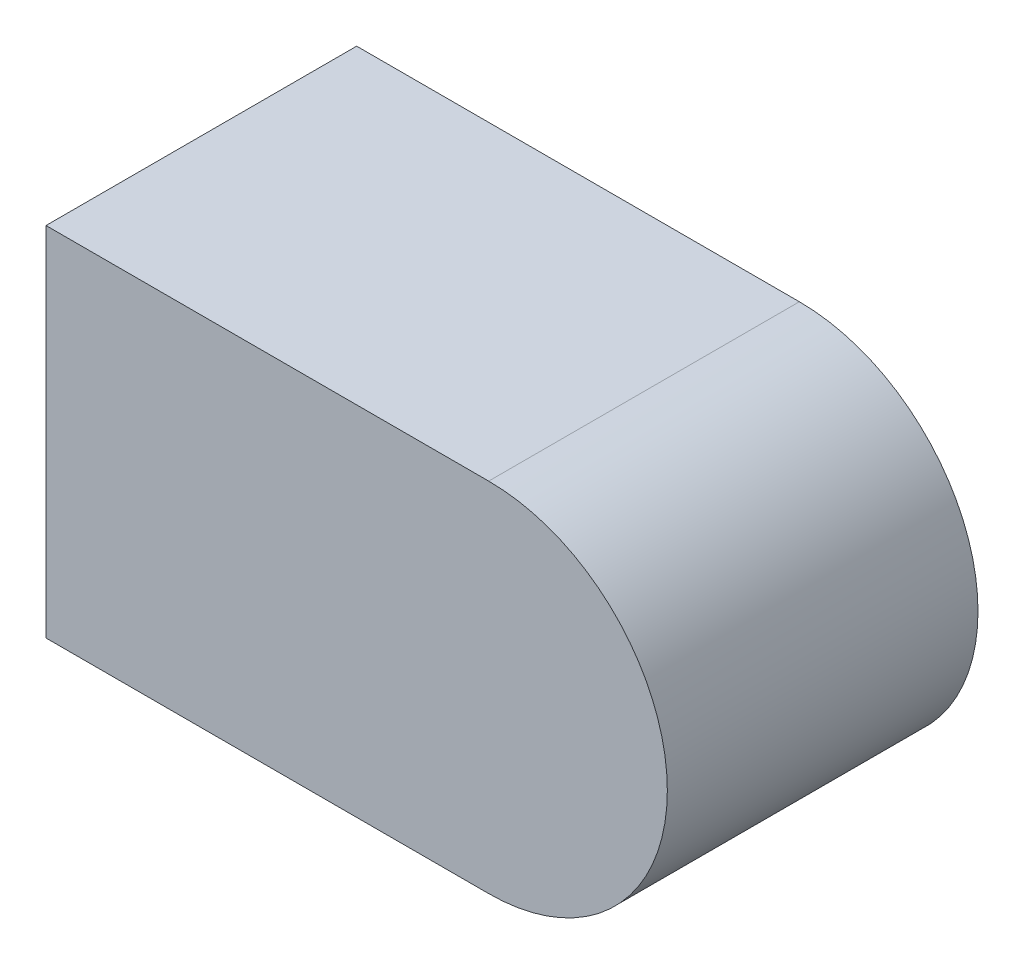
ISO-10303-21;
HEADER;
FILE_DESCRIPTION(('STEP AP214'),'2;1');
FILE_NAME('part.step','',(''),(''),'','','');
FILE_SCHEMA(('AUTOMOTIVE_DESIGN { 1 0 10303 214 1 1 1 1 }'));
ENDSEC;
DATA;
#1=APPLICATION_CONTEXT('core data for automotive mechanical design processes');
#2=APPLICATION_PROTOCOL_DEFINITION('international standard','automotive_design',2000,#1);
#3=PRODUCT_CONTEXT('',#1,'mechanical');
#4=PRODUCT('Part','Part','',(#3));
#5=PRODUCT_RELATED_PRODUCT_CATEGORY('part','',(#4));
#6=PRODUCT_DEFINITION_FORMATION('','',#4);
#7=PRODUCT_DEFINITION_CONTEXT('part definition',#1,'design');
#8=PRODUCT_DEFINITION('design','',#6,#7);
#9=PRODUCT_DEFINITION_SHAPE('','',#8);
#10=(LENGTH_UNIT() NAMED_UNIT(*) SI_UNIT(.MILLI.,.METRE.));
#11=(NAMED_UNIT(*) PLANE_ANGLE_UNIT() SI_UNIT($,.RADIAN.));
#12=(NAMED_UNIT(*) SI_UNIT($,.STERADIAN.) SOLID_ANGLE_UNIT());
#13=UNCERTAINTY_MEASURE_WITH_UNIT(LENGTH_MEASURE(1.E-05),#10,'distance_accuracy_value','');
#14=(GEOMETRIC_REPRESENTATION_CONTEXT(3) GLOBAL_UNCERTAINTY_ASSIGNED_CONTEXT((#13)) GLOBAL_UNIT_ASSIGNED_CONTEXT((#10,
#11,#12)) REPRESENTATION_CONTEXT('',''));
#15=CARTESIAN_POINT('',(0.,0.,0.));
#16=DIRECTION('',(0.,0.,1.));
#17=DIRECTION('',(1.,0.,0.));
#18=AXIS2_PLACEMENT_3D('',#15,#16,#17);
#19=CARTESIAN_POINT('',(-2.8335240809167,-0.75,0.2));
#20=DIRECTION('',(0.,0.,1.));
#21=DIRECTION('',(1.,0.,0.));
#22=AXIS2_PLACEMENT_3D('',#19,#20,#21);
#23=PLANE('',#22);
#24=DIRECTION('',(-1.,0.,0.));
#25=VECTOR('',#24,1.);
#26=CARTESIAN_POINT('',(-2.715,-0.635000000000001,0.2));
#27=LINE('',#26,#25);
#28=CARTESIAN_POINT('',(-2.715,-0.635000000000001,0.2));
#29=VERTEX_POINT('',#28);
#30=CARTESIAN_POINT('',(-3.,-0.635000000000001,0.2));
#31=VERTEX_POINT('',#30);
#32=EDGE_CURVE('E11',#29,#31,#27,.T.);
#33=ORIENTED_EDGE('',*,*,#32,.T.);
#34=DIRECTION('',(0.,-1.,0.));
#35=VECTOR('',#34,1.);
#36=CARTESIAN_POINT('',(-3.,1.125,0.2));
#37=LINE('',#36,#35);
#38=CARTESIAN_POINT('',(-3.,-0.865,0.2));
#39=VERTEX_POINT('',#38);
#40=EDGE_CURVE('E24',#31,#39,#37,.T.);
#41=ORIENTED_EDGE('',*,*,#40,.T.);
#42=DIRECTION('',(1.,0.,0.));
#43=VECTOR('',#42,1.);
#44=CARTESIAN_POINT('',(-3.,-0.865,0.2));
#45=LINE('',#44,#43);
#46=CARTESIAN_POINT('',(-2.715,-0.865,0.2));
#47=VERTEX_POINT('',#46);
#48=EDGE_CURVE('E88',#39,#47,#45,.T.);
#49=ORIENTED_EDGE('',*,*,#48,.T.);
#50=CARTESIAN_POINT('',(-2.715,-0.750000000000001,0.2));
#51=DIRECTION('',(0.,0.,1.));
#52=DIRECTION('',(0.,-1.,0.));
#53=AXIS2_PLACEMENT_3D('',#50,#51,#52);
#54=CIRCLE('',#53,0.115);
#55=EDGE_CURVE('E70',#47,#29,#54,.T.);
#56=ORIENTED_EDGE('',*,*,#55,.T.);
#57=EDGE_LOOP('',(#33,#41,#49,#56));
#58=FACE_BOUND('',#57,.T.);
#59=ADVANCED_FACE('F17',(#58),#23,.T.);
#60=CARTESIAN_POINT('',(-3.,3.,0.));
#61=DIRECTION('',(-1.,0.,0.));
#62=DIRECTION('',(0.,-1.,0.));
#63=AXIS2_PLACEMENT_3D('',#60,#61,#62);
#64=PLANE('',#63);
#65=DIRECTION('',(0.,0.,-1.));
#66=VECTOR('',#65,1.);
#67=CARTESIAN_POINT('',(-3.,-0.865,0.));
#68=LINE('',#67,#66);
#69=CARTESIAN_POINT('',(-3.,-0.865,0.));
#70=VERTEX_POINT('',#69);
#71=EDGE_CURVE('E76',#39,#70,#68,.T.);
#72=ORIENTED_EDGE('',*,*,#71,.F.);
#73=ORIENTED_EDGE('',*,*,#40,.F.);
#74=DIRECTION('',(0.,0.,1.));
#75=VECTOR('',#74,1.);
#76=CARTESIAN_POINT('',(-3.,-0.635000000000001,0.));
#77=LINE('',#76,#75);
#78=CARTESIAN_POINT('',(-3.,-0.635000000000001,0.));
#79=VERTEX_POINT('',#78);
#80=EDGE_CURVE('E84',#79,#31,#77,.T.);
#81=ORIENTED_EDGE('',*,*,#80,.F.);
#82=DIRECTION('',(0.,-1.,0.));
#83=VECTOR('',#82,1.);
#84=CARTESIAN_POINT('',(-3.,-0.635000000000001,0.));
#85=LINE('',#84,#83);
#86=EDGE_CURVE('E82',#79,#70,#85,.T.);
#87=ORIENTED_EDGE('',*,*,#86,.T.);
#88=EDGE_LOOP('',(#72,#73,#81,#87));
#89=FACE_BOUND('',#88,.T.);
#90=ADVANCED_FACE('F90',(#89),#64,.T.);
#91=CARTESIAN_POINT('',(-2.715,-0.635000000000001,0.));
#92=DIRECTION('',(0.,1.,0.));
#93=DIRECTION('',(-1.,0.,0.));
#94=AXIS2_PLACEMENT_3D('',#91,#92,#93);
#95=PLANE('',#94);
#96=DIRECTION('',(-1.,0.,0.));
#97=VECTOR('',#96,1.);
#98=CARTESIAN_POINT('',(-2.715,-0.635000000000001,0.));
#99=LINE('',#98,#97);
#100=CARTESIAN_POINT('',(-2.715,-0.635000000000001,0.));
#101=VERTEX_POINT('',#100);
#102=EDGE_CURVE('E61',#101,#79,#99,.T.);
#103=ORIENTED_EDGE('',*,*,#102,.T.);
#104=ORIENTED_EDGE('',*,*,#80,.T.);
#105=ORIENTED_EDGE('',*,*,#32,.F.);
#106=DIRECTION('',(0.,0.,1.));
#107=VECTOR('',#106,1.);
#108=CARTESIAN_POINT('',(-2.715,-0.635000000000001,0.));
#109=LINE('',#108,#107);
#110=EDGE_CURVE('E64',#101,#29,#109,.T.);
#111=ORIENTED_EDGE('',*,*,#110,.F.);
#112=EDGE_LOOP('',(#103,#104,#105,#111));
#113=FACE_BOUND('',#112,.T.);
#114=ADVANCED_FACE('F91',(#113),#95,.T.);
#115=CARTESIAN_POINT('',(-2.715,-0.750000000000001,0.));
#116=DIRECTION('',(0.,0.,1.));
#117=DIRECTION('',(0.,-1.,0.));
#118=AXIS2_PLACEMENT_3D('',#115,#116,#117);
#119=CYLINDRICAL_SURFACE('',#118,0.115);
#120=CARTESIAN_POINT('',(-2.715,-0.750000000000001,0.));
#121=DIRECTION('',(0.,0.,1.));
#122=DIRECTION('',(0.,-1.,0.));
#123=AXIS2_PLACEMENT_3D('',#120,#121,#122);
#124=CIRCLE('',#123,0.115);
#125=CARTESIAN_POINT('',(-2.715,-0.865,0.));
#126=VERTEX_POINT('',#125);
#127=EDGE_CURVE('E54',#126,#101,#124,.T.);
#128=ORIENTED_EDGE('',*,*,#127,.T.);
#129=ORIENTED_EDGE('',*,*,#110,.T.);
#130=ORIENTED_EDGE('',*,*,#55,.F.);
#131=DIRECTION('',(0.,0.,1.));
#132=VECTOR('',#131,1.);
#133=CARTESIAN_POINT('',(-2.715,-0.865,0.));
#134=LINE('',#133,#132);
#135=EDGE_CURVE('E65',#126,#47,#134,.T.);
#136=ORIENTED_EDGE('',*,*,#135,.F.);
#137=EDGE_LOOP('',(#128,#129,#130,#136));
#138=FACE_BOUND('',#137,.T.);
#139=ADVANCED_FACE('F69',(#138),#119,.T.);
#140=CARTESIAN_POINT('',(-3.,-0.865,0.));
#141=DIRECTION('',(0.,-1.,0.));
#142=DIRECTION('',(1.,0.,0.));
#143=AXIS2_PLACEMENT_3D('',#140,#141,#142);
#144=PLANE('',#143);
#145=DIRECTION('',(1.,0.,0.));
#146=VECTOR('',#145,1.);
#147=CARTESIAN_POINT('',(-3.,-0.865,0.));
#148=LINE('',#147,#146);
#149=EDGE_CURVE('E59',#70,#126,#148,.T.);
#150=ORIENTED_EDGE('',*,*,#149,.T.);
#151=ORIENTED_EDGE('',*,*,#135,.T.);
#152=ORIENTED_EDGE('',*,*,#48,.F.);
#153=ORIENTED_EDGE('',*,*,#71,.T.);
#154=EDGE_LOOP('',(#150,#151,#152,#153));
#155=FACE_BOUND('',#154,.T.);
#156=ADVANCED_FACE('F74',(#155),#144,.T.);
#157=CARTESIAN_POINT('',(-2.8335265642716,-0.75,0.));
#158=DIRECTION('',(0.,0.,1.));
#159=DIRECTION('',(1.,0.,0.));
#160=AXIS2_PLACEMENT_3D('',#157,#158,#159);
#161=PLANE('',#160);
#162=ORIENTED_EDGE('',*,*,#86,.F.);
#163=ORIENTED_EDGE('',*,*,#102,.F.);
#164=ORIENTED_EDGE('',*,*,#127,.F.);
#165=ORIENTED_EDGE('',*,*,#149,.F.);
#166=EDGE_LOOP('',(#162,#163,#164,#165));
#167=FACE_BOUND('',#166,.T.);
#168=ADVANCED_FACE('F57',(#167),#161,.F.);
#169=CLOSED_SHELL('',(#59,#90,#114,#139,#156,#168));
#170=MANIFOLD_SOLID_BREP('B1',#169);
#171=ADVANCED_BREP_SHAPE_REPRESENTATION('',(#18,#170),#14);
#172=SHAPE_DEFINITION_REPRESENTATION(#9,#171);
ENDSEC;
END-ISO-10303-21;
